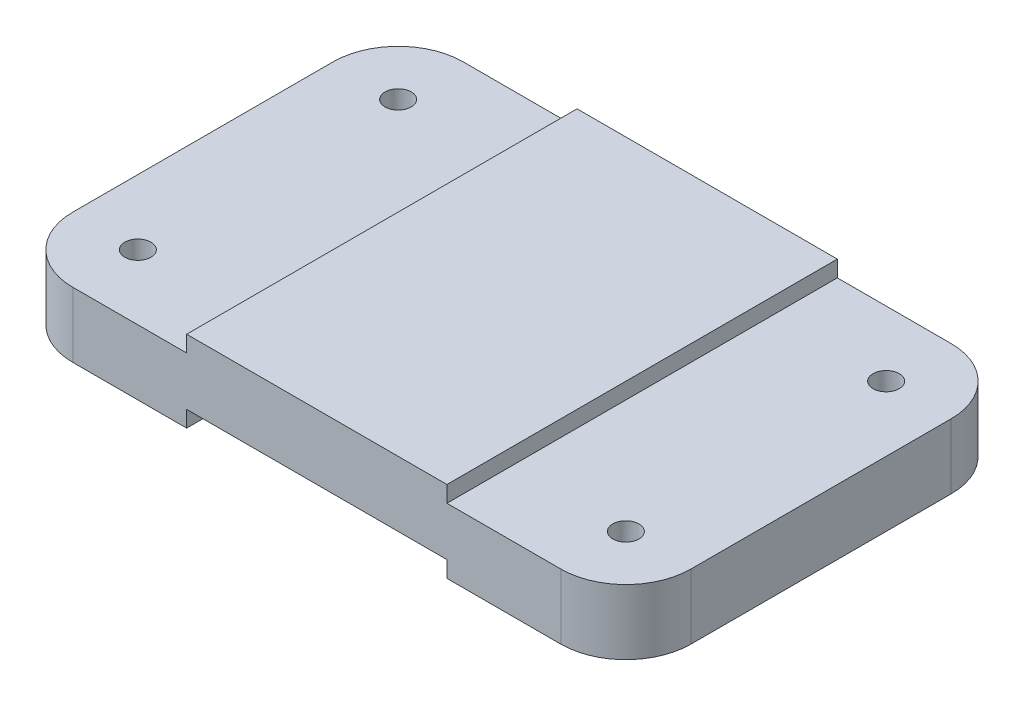
ISO-10303-21;
HEADER;
FILE_DESCRIPTION(('STEP AP214'),'2;1');
FILE_NAME('part.step','',(''),(''),'','','');
FILE_SCHEMA(('AUTOMOTIVE_DESIGN { 1 0 10303 214 1 1 1 1 }'));
ENDSEC;
DATA;
#1=APPLICATION_CONTEXT('core data for automotive mechanical design processes');
#2=APPLICATION_PROTOCOL_DEFINITION('international standard','automotive_design',2000,#1);
#3=PRODUCT_CONTEXT('',#1,'mechanical');
#4=PRODUCT('Part','Part','',(#3));
#5=PRODUCT_RELATED_PRODUCT_CATEGORY('part','',(#4));
#6=PRODUCT_DEFINITION_FORMATION('','',#4);
#7=PRODUCT_DEFINITION_CONTEXT('part definition',#1,'design');
#8=PRODUCT_DEFINITION('design','',#6,#7);
#9=PRODUCT_DEFINITION_SHAPE('','',#8);
#10=(LENGTH_UNIT() NAMED_UNIT(*) SI_UNIT(.MILLI.,.METRE.));
#11=(NAMED_UNIT(*) PLANE_ANGLE_UNIT() SI_UNIT($,.RADIAN.));
#12=(NAMED_UNIT(*) SI_UNIT($,.STERADIAN.) SOLID_ANGLE_UNIT());
#13=UNCERTAINTY_MEASURE_WITH_UNIT(LENGTH_MEASURE(1.E-05),#10,'distance_accuracy_value','');
#14=(GEOMETRIC_REPRESENTATION_CONTEXT(3) GLOBAL_UNCERTAINTY_ASSIGNED_CONTEXT((#13)) GLOBAL_UNIT_ASSIGNED_CONTEXT((#10,
#11,#12)) REPRESENTATION_CONTEXT('',''));
#15=CARTESIAN_POINT('',(0.,0.,0.));
#16=DIRECTION('',(0.,0.,1.));
#17=DIRECTION('',(1.,0.,0.));
#18=AXIS2_PLACEMENT_3D('',#15,#16,#17);
#19=CARTESIAN_POINT('',(-3.38666666666671,12.7,-76.2));
#20=DIRECTION('',(-1.,0.,0.));
#21=DIRECTION('',(0.,-1.,0.));
#22=AXIS2_PLACEMENT_3D('',#19,#20,#21);
#23=PLANE('',#22);
#24=DIRECTION('',(0.,0.,1.));
#25=VECTOR('',#24,1.);
#26=CARTESIAN_POINT('',(-3.38666666666671,12.7,-76.2));
#27=LINE('',#26,#25);
#28=CARTESIAN_POINT('',(-3.38666666666671,12.7,-63.5));
#29=VERTEX_POINT('',#28);
#30=CARTESIAN_POINT('',(-3.38666666666671,12.7,-12.7));
#31=VERTEX_POINT('',#30);
#32=EDGE_CURVE('E227',#29,#31,#27,.T.);
#33=ORIENTED_EDGE('',*,*,#32,.F.);
#34=DIRECTION('',(0.,-1.,0.));
#35=VECTOR('',#34,1.);
#36=CARTESIAN_POINT('',(-3.38666666666671,0.,-63.5));
#37=LINE('',#36,#35);
#38=CARTESIAN_POINT('',(-3.38666666666671,0.,-63.5));
#39=VERTEX_POINT('',#38);
#40=EDGE_CURVE('E270',#29,#39,#37,.T.);
#41=ORIENTED_EDGE('',*,*,#40,.T.);
#42=DIRECTION('',(0.,0.,1.));
#43=VECTOR('',#42,1.);
#44=CARTESIAN_POINT('',(-3.38666666666671,0.,-76.2));
#45=LINE('',#44,#43);
#46=CARTESIAN_POINT('',(-3.38666666666671,0.,-12.7));
#47=VERTEX_POINT('',#46);
#48=EDGE_CURVE('E170',#39,#47,#45,.T.);
#49=ORIENTED_EDGE('',*,*,#48,.T.);
#50=DIRECTION('',(0.,-1.,0.));
#51=VECTOR('',#50,1.);
#52=CARTESIAN_POINT('',(-3.38666666666671,12.7,-12.7));
#53=LINE('',#52,#51);
#54=EDGE_CURVE('E268',#47,#31,#53,.F.);
#55=ORIENTED_EDGE('',*,*,#54,.T.);
#56=EDGE_LOOP('',(#33,#41,#49,#55));
#57=FACE_BOUND('',#56,.T.);
#58=ADVANCED_FACE('F34',(#57),#23,.T.);
#59=CARTESIAN_POINT('',(31.5383333333333,12.7,-76.2));
#60=DIRECTION('',(0.,1.,0.));
#61=DIRECTION('',(-1.,0.,0.));
#62=AXIS2_PLACEMENT_3D('',#59,#60,#61);
#63=PLANE('',#62);
#64=CARTESIAN_POINT('',(9.31333333333333,12.7,-12.7));
#65=DIRECTION('',(0.,1.,0.));
#66=DIRECTION('',(0.,0.,1.));
#67=AXIS2_PLACEMENT_3D('',#64,#65,#66);
#68=CIRCLE('',#67,2.55269999999999);
#69=CARTESIAN_POINT('',(9.31333333333333,12.7,-10.1473));
#70=VERTEX_POINT('',#69);
#71=EDGE_CURVE('E400',#70,#70,#68,.T.);
#72=ORIENTED_EDGE('',*,*,#71,.F.);
#73=EDGE_LOOP('',(#72));
#74=FACE_BOUND('',#73,.T.);
#75=CARTESIAN_POINT('',(9.31333333333333,12.7,-63.5));
#76=DIRECTION('',(0.,1.,0.));
#77=DIRECTION('',(0.,0.,1.));
#78=AXIS2_PLACEMENT_3D('',#75,#76,#77);
#79=CIRCLE('',#78,2.55269999999999);
#80=CARTESIAN_POINT('',(9.31333333333333,12.7,-60.9473));
#81=VERTEX_POINT('',#80);
#82=EDGE_CURVE('E406',#81,#81,#79,.T.);
#83=ORIENTED_EDGE('',*,*,#82,.F.);
#84=EDGE_LOOP('',(#83));
#85=FACE_BOUND('',#84,.T.);
#86=DIRECTION('',(-1.,0.,0.));
#87=VECTOR('',#86,1.);
#88=CARTESIAN_POINT('',(31.5383333333333,12.7,-76.2));
#89=LINE('',#88,#87);
#90=CARTESIAN_POINT('',(31.5383333333333,12.7,-76.2));
#91=VERTEX_POINT('',#90);
#92=CARTESIAN_POINT('',(9.31333333333328,12.7,-76.2));
#93=VERTEX_POINT('',#92);
#94=EDGE_CURVE('E199',#91,#93,#89,.T.);
#95=ORIENTED_EDGE('',*,*,#94,.T.);
#96=CARTESIAN_POINT('',(9.31333333333329,12.7,-63.5));
#97=DIRECTION('',(0.,1.,0.));
#98=DIRECTION('',(-1.,0.,0.));
#99=AXIS2_PLACEMENT_3D('',#96,#97,#98);
#100=CIRCLE('',#99,12.7);
#101=EDGE_CURVE('E276',#93,#29,#100,.T.);
#102=ORIENTED_EDGE('',*,*,#101,.T.);
#103=ORIENTED_EDGE('',*,*,#32,.T.);
#104=CARTESIAN_POINT('',(9.31333333333329,12.7,-12.7));
#105=DIRECTION('',(0.,1.,0.));
#106=DIRECTION('',(-1.,0.,0.));
#107=AXIS2_PLACEMENT_3D('',#104,#105,#106);
#108=CIRCLE('',#107,12.7);
#109=CARTESIAN_POINT('',(9.31333333333328,12.7,0.));
#110=VERTEX_POINT('',#109);
#111=EDGE_CURVE('E50',#31,#110,#108,.T.);
#112=ORIENTED_EDGE('',*,*,#111,.T.);
#113=DIRECTION('',(-1.,0.,0.));
#114=VECTOR('',#113,1.);
#115=CARTESIAN_POINT('',(31.5383333333333,12.7,0.));
#116=LINE('',#115,#114);
#117=CARTESIAN_POINT('',(31.5383333333333,12.7,0.));
#118=VERTEX_POINT('',#117);
#119=EDGE_CURVE('E162',#118,#110,#116,.T.);
#120=ORIENTED_EDGE('',*,*,#119,.F.);
#121=DIRECTION('',(0.,0.,1.));
#122=VECTOR('',#121,1.);
#123=CARTESIAN_POINT('',(31.5383333333333,12.7,-76.2));
#124=LINE('',#123,#122);
#125=EDGE_CURVE('E230',#91,#118,#124,.T.);
#126=ORIENTED_EDGE('',*,*,#125,.F.);
#127=EDGE_LOOP('',(#95,#102,#103,#112,#120,#126));
#128=FACE_BOUND('',#127,.T.);
#129=ADVANCED_FACE('F303',(#74,#85,#128),#63,.T.);
#130=CARTESIAN_POINT('',(31.5383333333333,15.875,-76.2));
#131=DIRECTION('',(-1.,0.,0.));
#132=DIRECTION('',(0.,0.,1.));
#133=AXIS2_PLACEMENT_3D('',#130,#131,#132);
#134=PLANE('',#133);
#135=DIRECTION('',(0.,-1.,0.));
#136=VECTOR('',#135,1.);
#137=CARTESIAN_POINT('',(31.5383333333333,15.875,0.));
#138=LINE('',#137,#136);
#139=CARTESIAN_POINT('',(31.5383333333333,15.875,0.));
#140=VERTEX_POINT('',#139);
#141=EDGE_CURVE('E223',#140,#118,#138,.T.);
#142=ORIENTED_EDGE('',*,*,#141,.F.);
#143=DIRECTION('',(0.,0.,1.));
#144=VECTOR('',#143,1.);
#145=CARTESIAN_POINT('',(31.5383333333333,15.875,-76.2));
#146=LINE('',#145,#144);
#147=CARTESIAN_POINT('',(31.5383333333333,15.875,-76.2));
#148=VERTEX_POINT('',#147);
#149=EDGE_CURVE('E232',#148,#140,#146,.T.);
#150=ORIENTED_EDGE('',*,*,#149,.F.);
#151=DIRECTION('',(0.,-1.,0.));
#152=VECTOR('',#151,1.);
#153=CARTESIAN_POINT('',(31.5383333333333,15.875,-76.2));
#154=LINE('',#153,#152);
#155=EDGE_CURVE('E196',#148,#91,#154,.T.);
#156=ORIENTED_EDGE('',*,*,#155,.T.);
#157=ORIENTED_EDGE('',*,*,#125,.T.);
#158=EDGE_LOOP('',(#142,#150,#156,#157));
#159=FACE_BOUND('',#158,.T.);
#160=ADVANCED_FACE('F301',(#159),#134,.T.);
#161=CARTESIAN_POINT('',(82.3383333333333,15.875,-76.2));
#162=DIRECTION('',(0.,1.,0.));
#163=DIRECTION('',(-1.,0.,0.));
#164=AXIS2_PLACEMENT_3D('',#161,#162,#163);
#165=PLANE('',#164);
#166=DIRECTION('',(-1.,0.,0.));
#167=VECTOR('',#166,1.);
#168=CARTESIAN_POINT('',(82.3383333333333,15.875,0.));
#169=LINE('',#168,#167);
#170=CARTESIAN_POINT('',(82.3383333333333,15.875,0.));
#171=VERTEX_POINT('',#170);
#172=EDGE_CURVE('E220',#171,#140,#169,.T.);
#173=ORIENTED_EDGE('',*,*,#172,.F.);
#174=DIRECTION('',(0.,0.,1.));
#175=VECTOR('',#174,1.);
#176=CARTESIAN_POINT('',(82.3383333333333,15.875,-76.2));
#177=LINE('',#176,#175);
#178=CARTESIAN_POINT('',(82.3383333333333,15.875,-76.2));
#179=VERTEX_POINT('',#178);
#180=EDGE_CURVE('E234',#179,#171,#177,.T.);
#181=ORIENTED_EDGE('',*,*,#180,.F.);
#182=DIRECTION('',(-1.,0.,0.));
#183=VECTOR('',#182,1.);
#184=CARTESIAN_POINT('',(82.3383333333333,15.875,-76.2));
#185=LINE('',#184,#183);
#186=EDGE_CURVE('E193',#179,#148,#185,.T.);
#187=ORIENTED_EDGE('',*,*,#186,.T.);
#188=ORIENTED_EDGE('',*,*,#149,.T.);
#189=EDGE_LOOP('',(#173,#181,#187,#188));
#190=FACE_BOUND('',#189,.T.);
#191=ADVANCED_FACE('F297',(#190),#165,.T.);
#192=CARTESIAN_POINT('',(82.3383333333333,12.7,-76.2));
#193=DIRECTION('',(1.,0.,0.));
#194=DIRECTION('',(0.,0.,-1.));
#195=AXIS2_PLACEMENT_3D('',#192,#193,#194);
#196=PLANE('',#195);
#197=DIRECTION('',(0.,1.,0.));
#198=VECTOR('',#197,1.);
#199=CARTESIAN_POINT('',(82.3383333333333,12.7,0.));
#200=LINE('',#199,#198);
#201=CARTESIAN_POINT('',(82.3383333333333,12.7,0.));
#202=VERTEX_POINT('',#201);
#203=EDGE_CURVE('E217',#202,#171,#200,.T.);
#204=ORIENTED_EDGE('',*,*,#203,.F.);
#205=DIRECTION('',(0.,0.,1.));
#206=VECTOR('',#205,1.);
#207=CARTESIAN_POINT('',(82.3383333333333,12.7,-76.2));
#208=LINE('',#207,#206);
#209=CARTESIAN_POINT('',(82.3383333333333,12.7,-76.2));
#210=VERTEX_POINT('',#209);
#211=EDGE_CURVE('E236',#210,#202,#208,.T.);
#212=ORIENTED_EDGE('',*,*,#211,.F.);
#213=DIRECTION('',(0.,1.,0.));
#214=VECTOR('',#213,1.);
#215=CARTESIAN_POINT('',(82.3383333333333,12.7,-76.2));
#216=LINE('',#215,#214);
#217=EDGE_CURVE('E190',#210,#179,#216,.T.);
#218=ORIENTED_EDGE('',*,*,#217,.T.);
#219=ORIENTED_EDGE('',*,*,#180,.T.);
#220=EDGE_LOOP('',(#204,#212,#218,#219));
#221=FACE_BOUND('',#220,.T.);
#222=ADVANCED_FACE('F293',(#221),#196,.T.);
#223=CARTESIAN_POINT('',(117.263333333333,12.7,-76.2));
#224=DIRECTION('',(0.,1.,0.));
#225=DIRECTION('',(-1.,0.,0.));
#226=AXIS2_PLACEMENT_3D('',#223,#224,#225);
#227=PLANE('',#226);
#228=CARTESIAN_POINT('',(104.563333333333,12.7,-63.5));
#229=DIRECTION('',(0.,1.,0.));
#230=DIRECTION('',(0.,0.,1.));
#231=AXIS2_PLACEMENT_3D('',#228,#229,#230);
#232=CIRCLE('',#231,2.55269999999999);
#233=CARTESIAN_POINT('',(104.563333333333,12.7,-60.9473));
#234=VERTEX_POINT('',#233);
#235=EDGE_CURVE('E393',#234,#234,#232,.T.);
#236=ORIENTED_EDGE('',*,*,#235,.F.);
#237=EDGE_LOOP('',(#236));
#238=FACE_BOUND('',#237,.T.);
#239=CARTESIAN_POINT('',(104.563333333333,12.7,-12.7));
#240=DIRECTION('',(0.,1.,0.));
#241=DIRECTION('',(0.,0.,1.));
#242=AXIS2_PLACEMENT_3D('',#239,#240,#241);
#243=CIRCLE('',#242,2.55269999999999);
#244=CARTESIAN_POINT('',(104.563333333333,12.7,-10.1473));
#245=VERTEX_POINT('',#244);
#246=EDGE_CURVE('E395',#245,#245,#243,.T.);
#247=ORIENTED_EDGE('',*,*,#246,.F.);
#248=EDGE_LOOP('',(#247));
#249=FACE_BOUND('',#248,.T.);
#250=DIRECTION('',(0.,0.,1.));
#251=VECTOR('',#250,1.);
#252=CARTESIAN_POINT('',(117.263333333333,12.7,-76.2));
#253=LINE('',#252,#251);
#254=CARTESIAN_POINT('',(117.263333333333,12.7,-63.5));
#255=VERTEX_POINT('',#254);
#256=CARTESIAN_POINT('',(117.263333333333,12.7,-12.7));
#257=VERTEX_POINT('',#256);
#258=EDGE_CURVE('E239',#255,#257,#253,.T.);
#259=ORIENTED_EDGE('',*,*,#258,.F.);
#260=CARTESIAN_POINT('',(104.563333333333,12.7,-63.5));
#261=DIRECTION('',(0.,1.,0.));
#262=DIRECTION('',(-1.,0.,0.));
#263=AXIS2_PLACEMENT_3D('',#260,#261,#262);
#264=CIRCLE('',#263,12.7);
#265=CARTESIAN_POINT('',(104.563333333333,12.7,-76.2));
#266=VERTEX_POINT('',#265);
#267=EDGE_CURVE('E258',#255,#266,#264,.T.);
#268=ORIENTED_EDGE('',*,*,#267,.T.);
#269=DIRECTION('',(-1.,0.,0.));
#270=VECTOR('',#269,1.);
#271=CARTESIAN_POINT('',(117.263333333333,12.7,-76.2));
#272=LINE('',#271,#270);
#273=EDGE_CURVE('E188',#266,#210,#272,.T.);
#274=ORIENTED_EDGE('',*,*,#273,.T.);
#275=ORIENTED_EDGE('',*,*,#211,.T.);
#276=DIRECTION('',(-1.,0.,0.));
#277=VECTOR('',#276,1.);
#278=CARTESIAN_POINT('',(117.263333333333,12.7,0.));
#279=LINE('',#278,#277);
#280=CARTESIAN_POINT('',(104.563333333333,12.7,0.));
#281=VERTEX_POINT('',#280);
#282=EDGE_CURVE('E215',#281,#202,#279,.T.);
#283=ORIENTED_EDGE('',*,*,#282,.F.);
#284=CARTESIAN_POINT('',(104.563333333333,12.7,-12.7));
#285=DIRECTION('',(0.,1.,0.));
#286=DIRECTION('',(-1.,0.,0.));
#287=AXIS2_PLACEMENT_3D('',#284,#285,#286);
#288=CIRCLE('',#287,12.7);
#289=EDGE_CURVE('E256',#281,#257,#288,.T.);
#290=ORIENTED_EDGE('',*,*,#289,.T.);
#291=EDGE_LOOP('',(#259,#268,#274,#275,#283,#290));
#292=FACE_BOUND('',#291,.T.);
#293=ADVANCED_FACE('F288',(#238,#249,#292),#227,.T.);
#294=CARTESIAN_POINT('',(117.263333333333,0.,-76.2));
#295=DIRECTION('',(1.,0.,0.));
#296=DIRECTION('',(0.,0.,-1.));
#297=AXIS2_PLACEMENT_3D('',#294,#295,#296);
#298=PLANE('',#297);
#299=DIRECTION('',(0.,0.,1.));
#300=VECTOR('',#299,1.);
#301=CARTESIAN_POINT('',(117.263333333333,0.,-76.2));
#302=LINE('',#301,#300);
#303=CARTESIAN_POINT('',(117.263333333333,0.,-63.5));
#304=VERTEX_POINT('',#303);
#305=CARTESIAN_POINT('',(117.263333333333,0.,-12.7));
#306=VERTEX_POINT('',#305);
#307=EDGE_CURVE('E242',#304,#306,#302,.T.);
#308=ORIENTED_EDGE('',*,*,#307,.F.);
#309=DIRECTION('',(0.,1.,0.));
#310=VECTOR('',#309,1.);
#311=CARTESIAN_POINT('',(117.263333333333,12.7,-63.5));
#312=LINE('',#311,#310);
#313=EDGE_CURVE('E253',#304,#255,#312,.T.);
#314=ORIENTED_EDGE('',*,*,#313,.T.);
#315=ORIENTED_EDGE('',*,*,#258,.T.);
#316=DIRECTION('',(0.,1.,0.));
#317=VECTOR('',#316,1.);
#318=CARTESIAN_POINT('',(117.263333333333,0.,-12.7));
#319=LINE('',#318,#317);
#320=EDGE_CURVE('E229',#257,#306,#319,.F.);
#321=ORIENTED_EDGE('',*,*,#320,.T.);
#322=EDGE_LOOP('',(#308,#314,#315,#321));
#323=FACE_BOUND('',#322,.T.);
#324=ADVANCED_FACE('F323',(#323),#298,.T.);
#325=CARTESIAN_POINT('',(82.3383333333333,0.,-76.2));
#326=DIRECTION('',(0.,-1.,0.));
#327=DIRECTION('',(0.,0.,-1.));
#328=AXIS2_PLACEMENT_3D('',#325,#326,#327);
#329=PLANE('',#328);
#330=CARTESIAN_POINT('',(104.563333333333,0.,-63.5));
#331=DIRECTION('',(0.,-1.,0.));
#332=DIRECTION('',(0.,0.,-1.));
#333=AXIS2_PLACEMENT_3D('',#330,#331,#332);
#334=CIRCLE('',#333,2.55269999999999);
#335=CARTESIAN_POINT('',(104.563333333333,0.,-66.0527));
#336=VERTEX_POINT('',#335);
#337=EDGE_CURVE('E390',#336,#336,#334,.T.);
#338=ORIENTED_EDGE('',*,*,#337,.F.);
#339=EDGE_LOOP('',(#338));
#340=FACE_BOUND('',#339,.T.);
#341=CARTESIAN_POINT('',(104.563333333333,0.,-12.7));
#342=DIRECTION('',(0.,-1.,0.));
#343=DIRECTION('',(0.,0.,-1.));
#344=AXIS2_PLACEMENT_3D('',#341,#342,#343);
#345=CIRCLE('',#344,2.55269999999999);
#346=CARTESIAN_POINT('',(104.563333333333,0.,-15.2527));
#347=VERTEX_POINT('',#346);
#348=EDGE_CURVE('E38',#347,#347,#345,.T.);
#349=ORIENTED_EDGE('',*,*,#348,.F.);
#350=EDGE_LOOP('',(#349));
#351=FACE_BOUND('',#350,.T.);
#352=DIRECTION('',(1.,0.,0.));
#353=VECTOR('',#352,1.);
#354=CARTESIAN_POINT('',(82.3383333333333,0.,-76.2));
#355=LINE('',#354,#353);
#356=CARTESIAN_POINT('',(82.3383333333333,0.,-76.2));
#357=VERTEX_POINT('',#356);
#358=CARTESIAN_POINT('',(104.563333333333,0.,-76.2));
#359=VERTEX_POINT('',#358);
#360=EDGE_CURVE('E185',#357,#359,#355,.T.);
#361=ORIENTED_EDGE('',*,*,#360,.T.);
#362=CARTESIAN_POINT('',(104.563333333333,0.,-63.5));
#363=DIRECTION('',(0.,-1.,0.));
#364=DIRECTION('',(0.,0.,-1.));
#365=AXIS2_PLACEMENT_3D('',#362,#363,#364);
#366=CIRCLE('',#365,12.7);
#367=EDGE_CURVE('E266',#359,#304,#366,.T.);
#368=ORIENTED_EDGE('',*,*,#367,.T.);
#369=ORIENTED_EDGE('',*,*,#307,.T.);
#370=CARTESIAN_POINT('',(104.563333333333,0.,-12.7));
#371=DIRECTION('',(0.,-1.,0.));
#372=DIRECTION('',(0.,0.,-1.));
#373=AXIS2_PLACEMENT_3D('',#370,#371,#372);
#374=CIRCLE('',#373,12.7);
#375=CARTESIAN_POINT('',(104.563333333333,0.,0.));
#376=VERTEX_POINT('',#375);
#377=EDGE_CURVE('E264',#306,#376,#374,.T.);
#378=ORIENTED_EDGE('',*,*,#377,.T.);
#379=DIRECTION('',(1.,0.,0.));
#380=VECTOR('',#379,1.);
#381=CARTESIAN_POINT('',(82.3383333333333,0.,0.));
#382=LINE('',#381,#380);
#383=CARTESIAN_POINT('',(82.3383333333333,0.,0.));
#384=VERTEX_POINT('',#383);
#385=EDGE_CURVE('E212',#384,#376,#382,.T.);
#386=ORIENTED_EDGE('',*,*,#385,.F.);
#387=DIRECTION('',(0.,0.,1.));
#388=VECTOR('',#387,1.);
#389=CARTESIAN_POINT('',(82.3383333333333,0.,-76.2));
#390=LINE('',#389,#388);
#391=EDGE_CURVE('E245',#357,#384,#390,.T.);
#392=ORIENTED_EDGE('',*,*,#391,.F.);
#393=EDGE_LOOP('',(#361,#368,#369,#378,#386,#392));
#394=FACE_BOUND('',#393,.T.);
#395=ADVANCED_FACE('F319',(#340,#351,#394),#329,.T.);
#396=CARTESIAN_POINT('',(82.3383333333333,3.17500000000002,-76.2));
#397=DIRECTION('',(-1.,0.,0.));
#398=DIRECTION('',(0.,0.,1.));
#399=AXIS2_PLACEMENT_3D('',#396,#397,#398);
#400=PLANE('',#399);
#401=DIRECTION('',(0.,-1.,0.));
#402=VECTOR('',#401,1.);
#403=CARTESIAN_POINT('',(82.3383333333333,3.17500000000002,0.));
#404=LINE('',#403,#402);
#405=CARTESIAN_POINT('',(82.3383333333333,3.17500000000002,0.));
#406=VERTEX_POINT('',#405);
#407=EDGE_CURVE('E209',#406,#384,#404,.T.);
#408=ORIENTED_EDGE('',*,*,#407,.F.);
#409=DIRECTION('',(0.,0.,1.));
#410=VECTOR('',#409,1.);
#411=CARTESIAN_POINT('',(82.3383333333333,3.17500000000002,-76.2));
#412=LINE('',#411,#410);
#413=CARTESIAN_POINT('',(82.3383333333333,3.17500000000002,-76.2));
#414=VERTEX_POINT('',#413);
#415=EDGE_CURVE('E247',#414,#406,#412,.T.);
#416=ORIENTED_EDGE('',*,*,#415,.F.);
#417=DIRECTION('',(0.,-1.,0.));
#418=VECTOR('',#417,1.);
#419=CARTESIAN_POINT('',(82.3383333333333,3.17500000000002,-76.2));
#420=LINE('',#419,#418);
#421=EDGE_CURVE('E179',#414,#357,#420,.T.);
#422=ORIENTED_EDGE('',*,*,#421,.T.);
#423=ORIENTED_EDGE('',*,*,#391,.T.);
#424=EDGE_LOOP('',(#408,#416,#422,#423));
#425=FACE_BOUND('',#424,.T.);
#426=ADVANCED_FACE('F316',(#425),#400,.T.);
#427=CARTESIAN_POINT('',(31.5383333333333,3.175,-76.2));
#428=DIRECTION('',(0.,-1.,0.));
#429=DIRECTION('',(1.,0.,0.));
#430=AXIS2_PLACEMENT_3D('',#427,#428,#429);
#431=PLANE('',#430);
#432=DIRECTION('',(1.,0.,0.));
#433=VECTOR('',#432,1.);
#434=CARTESIAN_POINT('',(31.5383333333333,3.175,0.));
#435=LINE('',#434,#433);
#436=CARTESIAN_POINT('',(31.5383333333333,3.175,0.));
#437=VERTEX_POINT('',#436);
#438=EDGE_CURVE('E206',#437,#406,#435,.T.);
#439=ORIENTED_EDGE('',*,*,#438,.F.);
#440=DIRECTION('',(0.,0.,1.));
#441=VECTOR('',#440,1.);
#442=CARTESIAN_POINT('',(31.5383333333333,3.175,-76.2));
#443=LINE('',#442,#441);
#444=CARTESIAN_POINT('',(31.5383333333333,3.175,-76.2));
#445=VERTEX_POINT('',#444);
#446=EDGE_CURVE('E169',#445,#437,#443,.T.);
#447=ORIENTED_EDGE('',*,*,#446,.F.);
#448=DIRECTION('',(1.,0.,0.));
#449=VECTOR('',#448,1.);
#450=CARTESIAN_POINT('',(31.5383333333333,3.175,-76.2));
#451=LINE('',#450,#449);
#452=EDGE_CURVE('E177',#445,#414,#451,.T.);
#453=ORIENTED_EDGE('',*,*,#452,.T.);
#454=ORIENTED_EDGE('',*,*,#415,.T.);
#455=EDGE_LOOP('',(#439,#447,#453,#454));
#456=FACE_BOUND('',#455,.T.);
#457=ADVANCED_FACE('F314',(#456),#431,.T.);
#458=CARTESIAN_POINT('',(31.5383333333333,0.,-76.2));
#459=DIRECTION('',(1.,0.,0.));
#460=DIRECTION('',(0.,0.,-1.));
#461=AXIS2_PLACEMENT_3D('',#458,#459,#460);
#462=PLANE('',#461);
#463=DIRECTION('',(0.,1.,0.));
#464=VECTOR('',#463,1.);
#465=CARTESIAN_POINT('',(31.5383333333333,0.,0.));
#466=LINE('',#465,#464);
#467=CARTESIAN_POINT('',(31.5383333333333,0.,0.));
#468=VERTEX_POINT('',#467);
#469=EDGE_CURVE('E168',#468,#437,#466,.T.);
#470=ORIENTED_EDGE('',*,*,#469,.F.);
#471=DIRECTION('',(0.,0.,1.));
#472=VECTOR('',#471,1.);
#473=CARTESIAN_POINT('',(31.5383333333333,0.,-76.2));
#474=LINE('',#473,#472);
#475=CARTESIAN_POINT('',(31.5383333333333,0.,-76.2));
#476=VERTEX_POINT('',#475);
#477=EDGE_CURVE('E155',#476,#468,#474,.T.);
#478=ORIENTED_EDGE('',*,*,#477,.F.);
#479=DIRECTION('',(0.,1.,0.));
#480=VECTOR('',#479,1.);
#481=CARTESIAN_POINT('',(31.5383333333333,0.,-76.2));
#482=LINE('',#481,#480);
#483=EDGE_CURVE('E161',#476,#445,#482,.T.);
#484=ORIENTED_EDGE('',*,*,#483,.T.);
#485=ORIENTED_EDGE('',*,*,#446,.T.);
#486=EDGE_LOOP('',(#470,#478,#484,#485));
#487=FACE_BOUND('',#486,.T.);
#488=ADVANCED_FACE('F166',(#487),#462,.T.);
#489=CARTESIAN_POINT('',(-3.38666666666671,0.,-76.2));
#490=DIRECTION('',(0.,-1.,0.));
#491=DIRECTION('',(0.,0.,-1.));
#492=AXIS2_PLACEMENT_3D('',#489,#490,#491);
#493=PLANE('',#492);
#494=CARTESIAN_POINT('',(9.31333333333333,0.,-12.7));
#495=DIRECTION('',(0.,-1.,0.));
#496=DIRECTION('',(0.,0.,-1.));
#497=AXIS2_PLACEMENT_3D('',#494,#495,#496);
#498=CIRCLE('',#497,2.55269999999999);
#499=CARTESIAN_POINT('',(9.31333333333333,0.,-15.2527));
#500=VERTEX_POINT('',#499);
#501=EDGE_CURVE('E403',#500,#500,#498,.T.);
#502=ORIENTED_EDGE('',*,*,#501,.F.);
#503=EDGE_LOOP('',(#502));
#504=FACE_BOUND('',#503,.T.);
#505=CARTESIAN_POINT('',(9.31333333333333,0.,-63.5));
#506=DIRECTION('',(0.,-1.,0.));
#507=DIRECTION('',(0.,0.,-1.));
#508=AXIS2_PLACEMENT_3D('',#505,#506,#507);
#509=CIRCLE('',#508,2.55269999999999);
#510=CARTESIAN_POINT('',(9.31333333333333,0.,-66.0527));
#511=VERTEX_POINT('',#510);
#512=EDGE_CURVE('E204',#511,#511,#509,.T.);
#513=ORIENTED_EDGE('',*,*,#512,.F.);
#514=EDGE_LOOP('',(#513));
#515=FACE_BOUND('',#514,.T.);
#516=ORIENTED_EDGE('',*,*,#48,.F.);
#517=CARTESIAN_POINT('',(9.31333333333329,0.,-63.5));
#518=DIRECTION('',(0.,-1.,0.));
#519=DIRECTION('',(0.,0.,-1.));
#520=AXIS2_PLACEMENT_3D('',#517,#518,#519);
#521=CIRCLE('',#520,12.7);
#522=CARTESIAN_POINT('',(9.31333333333329,0.,-76.2));
#523=VERTEX_POINT('',#522);
#524=EDGE_CURVE('E157',#39,#523,#521,.T.);
#525=ORIENTED_EDGE('',*,*,#524,.T.);
#526=DIRECTION('',(1.,0.,0.));
#527=VECTOR('',#526,1.);
#528=CARTESIAN_POINT('',(-3.38666666666671,0.,-76.2));
#529=LINE('',#528,#527);
#530=EDGE_CURVE('E150',#523,#476,#529,.T.);
#531=ORIENTED_EDGE('',*,*,#530,.T.);
#532=ORIENTED_EDGE('',*,*,#477,.T.);
#533=DIRECTION('',(1.,0.,0.));
#534=VECTOR('',#533,1.);
#535=CARTESIAN_POINT('',(-3.38666666666671,0.,0.));
#536=LINE('',#535,#534);
#537=CARTESIAN_POINT('',(9.31333333333329,0.,0.));
#538=VERTEX_POINT('',#537);
#539=EDGE_CURVE('E202',#538,#468,#536,.T.);
#540=ORIENTED_EDGE('',*,*,#539,.F.);
#541=CARTESIAN_POINT('',(9.31333333333329,0.,-12.7));
#542=DIRECTION('',(0.,-1.,0.));
#543=DIRECTION('',(0.,0.,-1.));
#544=AXIS2_PLACEMENT_3D('',#541,#542,#543);
#545=CIRCLE('',#544,12.7);
#546=EDGE_CURVE('E58',#538,#47,#545,.T.);
#547=ORIENTED_EDGE('',*,*,#546,.T.);
#548=EDGE_LOOP('',(#516,#525,#531,#532,#540,#547));
#549=FACE_BOUND('',#548,.T.);
#550=ADVANCED_FACE('F153',(#504,#515,#549),#493,.T.);
#551=CARTESIAN_POINT('',(0.,0.,-76.2));
#552=DIRECTION('',(0.,0.,1.));
#553=DIRECTION('',(1.,0.,0.));
#554=AXIS2_PLACEMENT_3D('',#551,#552,#553);
#555=PLANE('',#554);
#556=ORIENTED_EDGE('',*,*,#273,.F.);
#557=DIRECTION('',(0.,1.,0.));
#558=VECTOR('',#557,1.);
#559=CARTESIAN_POINT('',(104.563333333333,0.,-76.2));
#560=LINE('',#559,#558);
#561=EDGE_CURVE('E262',#266,#359,#560,.F.);
#562=ORIENTED_EDGE('',*,*,#561,.T.);
#563=ORIENTED_EDGE('',*,*,#360,.F.);
#564=ORIENTED_EDGE('',*,*,#421,.F.);
#565=ORIENTED_EDGE('',*,*,#452,.F.);
#566=ORIENTED_EDGE('',*,*,#483,.F.);
#567=ORIENTED_EDGE('',*,*,#530,.F.);
#568=DIRECTION('',(0.,-1.,0.));
#569=VECTOR('',#568,1.);
#570=CARTESIAN_POINT('',(9.31333333333329,12.7,-76.2));
#571=LINE('',#570,#569);
#572=EDGE_CURVE('E260',#523,#93,#571,.F.);
#573=ORIENTED_EDGE('',*,*,#572,.T.);
#574=ORIENTED_EDGE('',*,*,#94,.F.);
#575=ORIENTED_EDGE('',*,*,#155,.F.);
#576=ORIENTED_EDGE('',*,*,#186,.F.);
#577=ORIENTED_EDGE('',*,*,#217,.F.);
#578=EDGE_LOOP('',(#556,#562,#563,#564,#565,#566,#567,#573,#574,#575,#576,#577));
#579=FACE_BOUND('',#578,.T.);
#580=ADVANCED_FACE('F174',(#579),#555,.F.);
#581=CARTESIAN_POINT('',(0.,0.,0.));
#582=DIRECTION('',(0.,0.,1.));
#583=DIRECTION('',(1.,0.,0.));
#584=AXIS2_PLACEMENT_3D('',#581,#582,#583);
#585=PLANE('',#584);
#586=ORIENTED_EDGE('',*,*,#119,.T.);
#587=DIRECTION('',(0.,-1.,0.));
#588=VECTOR('',#587,1.);
#589=CARTESIAN_POINT('',(9.31333333333329,0.,0.));
#590=LINE('',#589,#588);
#591=EDGE_CURVE('E11',#110,#538,#590,.T.);
#592=ORIENTED_EDGE('',*,*,#591,.T.);
#593=ORIENTED_EDGE('',*,*,#539,.T.);
#594=ORIENTED_EDGE('',*,*,#469,.T.);
#595=ORIENTED_EDGE('',*,*,#438,.T.);
#596=ORIENTED_EDGE('',*,*,#407,.T.);
#597=ORIENTED_EDGE('',*,*,#385,.T.);
#598=DIRECTION('',(0.,1.,0.));
#599=VECTOR('',#598,1.);
#600=CARTESIAN_POINT('',(104.563333333333,0.,0.));
#601=LINE('',#600,#599);
#602=EDGE_CURVE('E43',#376,#281,#601,.T.);
#603=ORIENTED_EDGE('',*,*,#602,.T.);
#604=ORIENTED_EDGE('',*,*,#282,.T.);
#605=ORIENTED_EDGE('',*,*,#203,.T.);
#606=ORIENTED_EDGE('',*,*,#172,.T.);
#607=ORIENTED_EDGE('',*,*,#141,.T.);
#608=EDGE_LOOP('',(#586,#592,#593,#594,#595,#596,#597,#603,#604,#605,#606,#607));
#609=FACE_BOUND('',#608,.T.);
#610=ADVANCED_FACE('F282',(#609),#585,.T.);
#611=CARTESIAN_POINT('',(104.563333333333,0.,-63.5));
#612=DIRECTION('',(0.,-1.,0.));
#613=DIRECTION('',(0.,0.,-1.));
#614=AXIS2_PLACEMENT_3D('',#611,#612,#613);
#615=CYLINDRICAL_SURFACE('',#614,12.7);
#616=ORIENTED_EDGE('',*,*,#367,.F.);
#617=ORIENTED_EDGE('',*,*,#561,.F.);
#618=ORIENTED_EDGE('',*,*,#267,.F.);
#619=ORIENTED_EDGE('',*,*,#313,.F.);
#620=EDGE_LOOP('',(#616,#617,#618,#619));
#621=FACE_BOUND('',#620,.T.);
#622=ADVANCED_FACE('F328',(#621),#615,.T.);
#623=CARTESIAN_POINT('',(9.31333333333329,12.7,-63.5));
#624=DIRECTION('',(0.,1.,0.));
#625=DIRECTION('',(-1.,0.,0.));
#626=AXIS2_PLACEMENT_3D('',#623,#624,#625);
#627=CYLINDRICAL_SURFACE('',#626,12.7);
#628=ORIENTED_EDGE('',*,*,#101,.F.);
#629=ORIENTED_EDGE('',*,*,#572,.F.);
#630=ORIENTED_EDGE('',*,*,#524,.F.);
#631=ORIENTED_EDGE('',*,*,#40,.F.);
#632=EDGE_LOOP('',(#628,#629,#630,#631));
#633=FACE_BOUND('',#632,.T.);
#634=ADVANCED_FACE('F310',(#633),#627,.T.);
#635=CARTESIAN_POINT('',(9.31333333333329,0.,-12.7));
#636=DIRECTION('',(0.,-1.,0.));
#637=DIRECTION('',(1.,0.,0.));
#638=AXIS2_PLACEMENT_3D('',#635,#636,#637);
#639=CYLINDRICAL_SURFACE('',#638,12.7);
#640=ORIENTED_EDGE('',*,*,#111,.F.);
#641=ORIENTED_EDGE('',*,*,#54,.F.);
#642=ORIENTED_EDGE('',*,*,#546,.F.);
#643=ORIENTED_EDGE('',*,*,#591,.F.);
#644=EDGE_LOOP('',(#640,#641,#642,#643));
#645=FACE_BOUND('',#644,.T.);
#646=ADVANCED_FACE('F305',(#645),#639,.T.);
#647=CARTESIAN_POINT('',(104.563333333333,0.,-12.7));
#648=DIRECTION('',(0.,1.,0.));
#649=DIRECTION('',(0.,0.,1.));
#650=AXIS2_PLACEMENT_3D('',#647,#648,#649);
#651=CYLINDRICAL_SURFACE('',#650,12.7);
#652=ORIENTED_EDGE('',*,*,#377,.F.);
#653=ORIENTED_EDGE('',*,*,#320,.F.);
#654=ORIENTED_EDGE('',*,*,#289,.F.);
#655=ORIENTED_EDGE('',*,*,#602,.F.);
#656=EDGE_LOOP('',(#652,#653,#654,#655));
#657=FACE_BOUND('',#656,.T.);
#658=ADVANCED_FACE('F36',(#657),#651,.T.);
#659=CARTESIAN_POINT('',(9.31333333333333,12.7,-63.5));
#660=DIRECTION('',(0.,1.,0.));
#661=DIRECTION('',(0.,0.,1.));
#662=AXIS2_PLACEMENT_3D('',#659,#660,#661);
#663=CYLINDRICAL_SURFACE('',#662,2.55269999999999);
#664=ORIENTED_EDGE('',*,*,#512,.T.);
#665=EDGE_LOOP('',(#664));
#666=FACE_BOUND('',#665,.T.);
#667=ORIENTED_EDGE('',*,*,#82,.T.);
#668=EDGE_LOOP('',(#667));
#669=FACE_BOUND('',#668,.T.);
#670=ADVANCED_FACE('F370',(#666,#669),#663,.F.);
#671=CARTESIAN_POINT('',(9.31333333333333,12.7,-12.7));
#672=DIRECTION('',(0.,1.,0.));
#673=DIRECTION('',(0.,0.,1.));
#674=AXIS2_PLACEMENT_3D('',#671,#672,#673);
#675=CYLINDRICAL_SURFACE('',#674,2.55269999999999);
#676=ORIENTED_EDGE('',*,*,#501,.T.);
#677=EDGE_LOOP('',(#676));
#678=FACE_BOUND('',#677,.T.);
#679=ORIENTED_EDGE('',*,*,#71,.T.);
#680=EDGE_LOOP('',(#679));
#681=FACE_BOUND('',#680,.T.);
#682=ADVANCED_FACE('F373',(#678,#681),#675,.F.);
#683=CARTESIAN_POINT('',(104.563333333333,12.7,-12.7));
#684=DIRECTION('',(0.,1.,0.));
#685=DIRECTION('',(0.,0.,1.));
#686=AXIS2_PLACEMENT_3D('',#683,#684,#685);
#687=CYLINDRICAL_SURFACE('',#686,2.55269999999999);
#688=ORIENTED_EDGE('',*,*,#348,.T.);
#689=EDGE_LOOP('',(#688));
#690=FACE_BOUND('',#689,.T.);
#691=ORIENTED_EDGE('',*,*,#246,.T.);
#692=EDGE_LOOP('',(#691));
#693=FACE_BOUND('',#692,.T.);
#694=ADVANCED_FACE('F377',(#690,#693),#687,.F.);
#695=CARTESIAN_POINT('',(104.563333333333,12.7,-63.5));
#696=DIRECTION('',(0.,1.,0.));
#697=DIRECTION('',(0.,0.,1.));
#698=AXIS2_PLACEMENT_3D('',#695,#696,#697);
#699=CYLINDRICAL_SURFACE('',#698,2.55269999999999);
#700=ORIENTED_EDGE('',*,*,#337,.T.);
#701=EDGE_LOOP('',(#700));
#702=FACE_BOUND('',#701,.T.);
#703=ORIENTED_EDGE('',*,*,#235,.T.);
#704=EDGE_LOOP('',(#703));
#705=FACE_BOUND('',#704,.T.);
#706=ADVANCED_FACE('F381',(#702,#705),#699,.F.);
#707=CLOSED_SHELL('',(#58,#129,#160,#191,#222,#293,#324,#395,#426,#457,#488,#550,#580,#610,#622,
#634,#646,#658,#670,#682,#694,#706));
#708=MANIFOLD_SOLID_BREP('B2',#707);
#709=ADVANCED_BREP_SHAPE_REPRESENTATION('',(#18,#708),#14);
#710=SHAPE_DEFINITION_REPRESENTATION(#9,#709);
ENDSEC;
END-ISO-10303-21;
